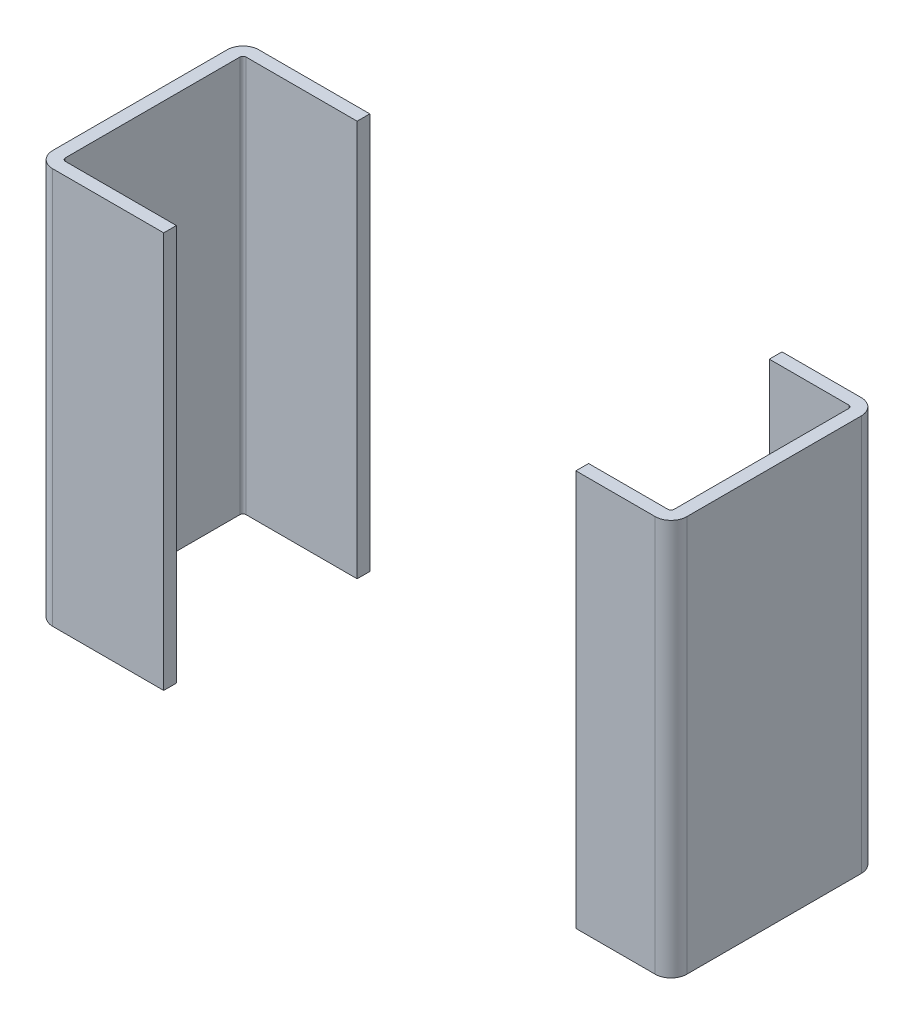
ISO-10303-21;
HEADER;
FILE_DESCRIPTION(('STEP AP214'),'2;1');
FILE_NAME('part.step','',(''),(''),'','','');
FILE_SCHEMA(('AUTOMOTIVE_DESIGN { 1 0 10303 214 1 1 1 1 }'));
ENDSEC;
DATA;
#1=APPLICATION_CONTEXT('core data for automotive mechanical design processes');
#2=APPLICATION_PROTOCOL_DEFINITION('international standard','automotive_design',2000,#1);
#3=PRODUCT_CONTEXT('',#1,'mechanical');
#4=PRODUCT('Part','Part','',(#3));
#5=PRODUCT_RELATED_PRODUCT_CATEGORY('part','',(#4));
#6=PRODUCT_DEFINITION_FORMATION('','',#4);
#7=PRODUCT_DEFINITION_CONTEXT('part definition',#1,'design');
#8=PRODUCT_DEFINITION('design','',#6,#7);
#9=PRODUCT_DEFINITION_SHAPE('','',#8);
#10=(LENGTH_UNIT() NAMED_UNIT(*) SI_UNIT(.MILLI.,.METRE.));
#11=(NAMED_UNIT(*) PLANE_ANGLE_UNIT() SI_UNIT($,.RADIAN.));
#12=(NAMED_UNIT(*) SI_UNIT($,.STERADIAN.) SOLID_ANGLE_UNIT());
#13=UNCERTAINTY_MEASURE_WITH_UNIT(LENGTH_MEASURE(1.E-05),#10,'distance_accuracy_value','');
#14=(GEOMETRIC_REPRESENTATION_CONTEXT(3) GLOBAL_UNCERTAINTY_ASSIGNED_CONTEXT((#13)) GLOBAL_UNIT_ASSIGNED_CONTEXT((#10,
#11,#12)) REPRESENTATION_CONTEXT('',''));
#15=CARTESIAN_POINT('',(0.,0.,0.));
#16=DIRECTION('',(0.,0.,1.));
#17=DIRECTION('',(1.,0.,0.));
#18=AXIS2_PLACEMENT_3D('',#15,#16,#17);
#19=CARTESIAN_POINT('',(0.95,-0.3125,0.6));
#20=DIRECTION('',(0.,1.,0.));
#21=DIRECTION('',(0.707106781186548,0.,0.707106781186548));
#22=AXIS2_PLACEMENT_3D('',#19,#20,#21);
#23=CYLINDRICAL_SURFACE('',#22,0.05);
#24=CARTESIAN_POINT('',(0.95,0.625,0.6));
#25=DIRECTION('',(0.,-1.,0.));
#26=DIRECTION('',(0.707106781186548,0.,0.707106781186548));
#27=AXIS2_PLACEMENT_3D('',#24,#25,#26);
#28=CIRCLE('',#27,0.05);
#29=CARTESIAN_POINT('',(1.,0.625,0.6));
#30=VERTEX_POINT('',#29);
#31=CARTESIAN_POINT('',(0.95,0.625,0.65));
#32=VERTEX_POINT('',#31);
#33=EDGE_CURVE('P0_E144',#30,#32,#28,.T.);
#34=ORIENTED_EDGE('',*,*,#33,.T.);
#35=DIRECTION('',(0.,-1.,0.));
#36=VECTOR('',#35,1.);
#37=CARTESIAN_POINT('',(0.95,-0.3125,0.65));
#38=LINE('',#37,#36);
#39=CARTESIAN_POINT('',(0.95,-0.625,0.65));
#40=VERTEX_POINT('',#39);
#41=EDGE_CURVE('P0_E138',#32,#40,#38,.T.);
#42=ORIENTED_EDGE('',*,*,#41,.T.);
#43=CARTESIAN_POINT('',(0.95,-0.625,0.6));
#44=DIRECTION('',(0.,1.,0.));
#45=DIRECTION('',(0.707106781186548,0.,0.707106781186548));
#46=AXIS2_PLACEMENT_3D('',#43,#44,#45);
#47=CIRCLE('',#46,0.05);
#48=CARTESIAN_POINT('',(1.,-0.625,0.6));
#49=VERTEX_POINT('',#48);
#50=EDGE_CURVE('P0_E141',#40,#49,#47,.T.);
#51=ORIENTED_EDGE('',*,*,#50,.T.);
#52=DIRECTION('',(0.,1.,0.));
#53=VECTOR('',#52,1.);
#54=CARTESIAN_POINT('',(1.,-0.3125,0.6));
#55=LINE('',#54,#53);
#56=EDGE_CURVE('P0_E11',#49,#30,#55,.T.);
#57=ORIENTED_EDGE('',*,*,#56,.T.);
#58=EDGE_LOOP('',(#34,#42,#51,#57));
#59=FACE_BOUND('',#58,.T.);
#60=ADVANCED_FACE('P0_F16',(#59),#23,.T.);
#61=CARTESIAN_POINT('',(1.,-0.625,0.));
#62=DIRECTION('',(1.,0.,0.));
#63=DIRECTION('',(0.,1.,0.));
#64=AXIS2_PLACEMENT_3D('',#61,#62,#63);
#65=PLANE('',#64);
#66=DIRECTION('',(0.,-1.,0.));
#67=VECTOR('',#66,1.);
#68=CARTESIAN_POINT('',(1.,-0.3125,0.05));
#69=LINE('',#68,#67);
#70=CARTESIAN_POINT('',(1.,0.625,0.05));
#71=VERTEX_POINT('',#70);
#72=CARTESIAN_POINT('',(1.,-0.625,0.05));
#73=VERTEX_POINT('',#72);
#74=EDGE_CURVE('P0_E27',#71,#73,#69,.T.);
#75=ORIENTED_EDGE('',*,*,#74,.F.);
#76=DIRECTION('',(0.,0.,1.));
#77=VECTOR('',#76,1.);
#78=CARTESIAN_POINT('',(1.,0.625,0.));
#79=LINE('',#78,#77);
#80=EDGE_CURVE('P0_E223',#71,#30,#79,.T.);
#81=ORIENTED_EDGE('',*,*,#80,.T.);
#82=ORIENTED_EDGE('',*,*,#56,.F.);
#83=DIRECTION('',(0.,0.,1.));
#84=VECTOR('',#83,1.);
#85=CARTESIAN_POINT('',(1.,-0.625,0.));
#86=LINE('',#85,#84);
#87=EDGE_CURVE('P0_E161',#73,#49,#86,.T.);
#88=ORIENTED_EDGE('',*,*,#87,.F.);
#89=EDGE_LOOP('',(#75,#81,#82,#88));
#90=FACE_BOUND('',#89,.T.);
#91=ADVANCED_FACE('P0_F380',(#90),#65,.T.);
#92=CARTESIAN_POINT('',(0.95,-0.3125,0.05));
#93=DIRECTION('',(0.,1.,0.));
#94=DIRECTION('',(0.707106781186548,0.,-0.707106781186548));
#95=AXIS2_PLACEMENT_3D('',#92,#93,#94);
#96=CYLINDRICAL_SURFACE('',#95,0.05);
#97=CARTESIAN_POINT('',(0.95,0.625,0.05));
#98=DIRECTION('',(0.,-1.,0.));
#99=DIRECTION('',(0.707106781186548,0.,-0.707106781186548));
#100=AXIS2_PLACEMENT_3D('',#97,#98,#99);
#101=CIRCLE('',#100,0.05);
#102=CARTESIAN_POINT('',(0.95,0.625,0.));
#103=VERTEX_POINT('',#102);
#104=EDGE_CURVE('P0_E149',#103,#71,#101,.T.);
#105=ORIENTED_EDGE('',*,*,#104,.T.);
#106=ORIENTED_EDGE('',*,*,#74,.T.);
#107=CARTESIAN_POINT('',(0.95,-0.625,0.05));
#108=DIRECTION('',(0.,1.,0.));
#109=DIRECTION('',(0.707106781186548,0.,-0.707106781186548));
#110=AXIS2_PLACEMENT_3D('',#107,#108,#109);
#111=CIRCLE('',#110,0.05);
#112=CARTESIAN_POINT('',(0.95,-0.625,0.));
#113=VERTEX_POINT('',#112);
#114=EDGE_CURVE('P0_E168',#73,#113,#111,.T.);
#115=ORIENTED_EDGE('',*,*,#114,.T.);
#116=DIRECTION('',(0.,1.,0.));
#117=VECTOR('',#116,1.);
#118=CARTESIAN_POINT('',(0.95,-0.3125,0.));
#119=LINE('',#118,#117);
#120=EDGE_CURVE('P0_E212',#113,#103,#119,.T.);
#121=ORIENTED_EDGE('',*,*,#120,.T.);
#122=EDGE_LOOP('',(#105,#106,#115,#121));
#123=FACE_BOUND('',#122,.T.);
#124=ADVANCED_FACE('P0_F375',(#123),#96,.T.);
#125=CARTESIAN_POINT('',(0.,0.,0.65));
#126=DIRECTION('',(0.,0.,1.));
#127=DIRECTION('',(1.,0.,0.));
#128=AXIS2_PLACEMENT_3D('',#125,#126,#127);
#129=PLANE('',#128);
#130=DIRECTION('',(0.,1.,0.));
#131=VECTOR('',#130,1.);
#132=CARTESIAN_POINT('',(0.7,0.3125,0.65));
#133=LINE('',#132,#131);
#134=CARTESIAN_POINT('',(0.7,-0.625,0.65));
#135=VERTEX_POINT('',#134);
#136=CARTESIAN_POINT('',(0.7,0.625,0.65));
#137=VERTEX_POINT('',#136);
#138=EDGE_CURVE('P0_E155',#135,#137,#133,.T.);
#139=ORIENTED_EDGE('',*,*,#138,.F.);
#140=DIRECTION('',(1.,0.,0.));
#141=VECTOR('',#140,1.);
#142=CARTESIAN_POINT('',(-1.,-0.625,0.65));
#143=LINE('',#142,#141);
#144=EDGE_CURVE('P0_E152',#135,#40,#143,.T.);
#145=ORIENTED_EDGE('',*,*,#144,.T.);
#146=ORIENTED_EDGE('',*,*,#41,.F.);
#147=DIRECTION('',(-1.,0.,0.));
#148=VECTOR('',#147,1.);
#149=CARTESIAN_POINT('',(1.,0.625,0.65));
#150=LINE('',#149,#148);
#151=EDGE_CURVE('P0_E216',#32,#137,#150,.T.);
#152=ORIENTED_EDGE('',*,*,#151,.T.);
#153=EDGE_LOOP('',(#139,#145,#146,#152));
#154=FACE_BOUND('',#153,.T.);
#155=ADVANCED_FACE('P0_F153',(#154),#129,.T.);
#156=CARTESIAN_POINT('',(1.,0.625,0.));
#157=DIRECTION('',(0.,1.,0.));
#158=DIRECTION('',(1.,0.,0.));
#159=AXIS2_PLACEMENT_3D('',#156,#157,#158);
#160=PLANE('',#159);
#161=DIRECTION('',(0.,0.,-1.));
#162=VECTOR('',#161,1.);
#163=CARTESIAN_POINT('',(0.7,0.625,0.325));
#164=LINE('',#163,#162);
#165=CARTESIAN_POINT('',(0.7,0.625,0.61));
#166=VERTEX_POINT('',#165);
#167=EDGE_CURVE('P0_E218',#137,#166,#164,.T.);
#168=ORIENTED_EDGE('',*,*,#167,.F.);
#169=ORIENTED_EDGE('',*,*,#151,.F.);
#170=ORIENTED_EDGE('',*,*,#33,.F.);
#171=ORIENTED_EDGE('',*,*,#80,.F.);
#172=ORIENTED_EDGE('',*,*,#104,.F.);
#173=DIRECTION('',(-1.,0.,0.));
#174=VECTOR('',#173,1.);
#175=CARTESIAN_POINT('',(1.,0.625,0.));
#176=LINE('',#175,#174);
#177=CARTESIAN_POINT('',(0.7,0.625,0.));
#178=VERTEX_POINT('',#177);
#179=EDGE_CURVE('P0_E121',#103,#178,#176,.T.);
#180=ORIENTED_EDGE('',*,*,#179,.T.);
#181=DIRECTION('',(0.,0.,-1.));
#182=VECTOR('',#181,1.);
#183=CARTESIAN_POINT('',(0.7,0.625,0.02));
#184=LINE('',#183,#182);
#185=CARTESIAN_POINT('',(0.7,0.625,0.04));
#186=VERTEX_POINT('',#185);
#187=EDGE_CURVE('P0_E186',#186,#178,#184,.T.);
#188=ORIENTED_EDGE('',*,*,#187,.F.);
#189=DIRECTION('',(-1.,0.,0.));
#190=VECTOR('',#189,1.);
#191=CARTESIAN_POINT('',(0.975000000012,0.625,0.04));
#192=LINE('',#191,#190);
#193=CARTESIAN_POINT('',(0.950000000023,0.625,0.04));
#194=VERTEX_POINT('',#193);
#195=EDGE_CURVE('P0_E192',#194,#186,#192,.T.);
#196=ORIENTED_EDGE('',*,*,#195,.F.);
#197=CARTESIAN_POINT('',(0.95,0.625,0.05));
#198=DIRECTION('',(0.,1.,0.));
#199=DIRECTION('',(-1.,0.,-4.656611901632E-09));
#200=AXIS2_PLACEMENT_3D('',#197,#198,#199);
#201=CIRCLE('',#200,0.01);
#202=CARTESIAN_POINT('',(0.96,0.625,0.05000000004657));
#203=VERTEX_POINT('',#202);
#204=EDGE_CURVE('P0_E200',#203,#194,#201,.T.);
#205=ORIENTED_EDGE('',*,*,#204,.F.);
#206=DIRECTION('',(0.,0.,-1.));
#207=VECTOR('',#206,1.);
#208=CARTESIAN_POINT('',(0.96,0.625,0.3));
#209=LINE('',#208,#207);
#210=CARTESIAN_POINT('',(0.96,0.625,0.6));
#211=VERTEX_POINT('',#210);
#212=EDGE_CURVE('P0_E180',#211,#203,#209,.T.);
#213=ORIENTED_EDGE('',*,*,#212,.F.);
#214=CARTESIAN_POINT('',(0.95,0.625,0.6));
#215=DIRECTION('',(0.,1.,0.));
#216=DIRECTION('',(-2.328304216093E-09,0.,-1.));
#217=AXIS2_PLACEMENT_3D('',#214,#215,#216);
#218=CIRCLE('',#217,0.01);
#219=CARTESIAN_POINT('',(0.950000000023,0.625,0.61));
#220=VERTEX_POINT('',#219);
#221=EDGE_CURVE('P0_E184',#220,#211,#218,.T.);
#222=ORIENTED_EDGE('',*,*,#221,.F.);
#223=DIRECTION('',(1.,0.,0.));
#224=VECTOR('',#223,1.);
#225=CARTESIAN_POINT('',(0.85,0.625,0.61));
#226=LINE('',#225,#224);
#227=EDGE_CURVE('P0_E207',#166,#220,#226,.T.);
#228=ORIENTED_EDGE('',*,*,#227,.F.);
#229=EDGE_LOOP('',(#168,#169,#170,#171,#172,#180,#188,#196,#205,#213,#222,#228));
#230=FACE_BOUND('',#229,.T.);
#231=ADVANCED_FACE('P0_F240',(#230),#160,.T.);
#232=CARTESIAN_POINT('',(0.,0.,0.));
#233=DIRECTION('',(0.,0.,1.));
#234=DIRECTION('',(1.,0.,0.));
#235=AXIS2_PLACEMENT_3D('',#232,#233,#234);
#236=PLANE('',#235);
#237=DIRECTION('',(0.,-1.,0.));
#238=VECTOR('',#237,1.);
#239=CARTESIAN_POINT('',(0.7,0.3125,0.));
#240=LINE('',#239,#238);
#241=CARTESIAN_POINT('',(0.7,-0.625,0.));
#242=VERTEX_POINT('',#241);
#243=EDGE_CURVE('P0_E190',#178,#242,#240,.T.);
#244=ORIENTED_EDGE('',*,*,#243,.F.);
#245=ORIENTED_EDGE('',*,*,#179,.F.);
#246=ORIENTED_EDGE('',*,*,#120,.F.);
#247=DIRECTION('',(1.,0.,0.));
#248=VECTOR('',#247,1.);
#249=CARTESIAN_POINT('',(-1.,-0.625,0.));
#250=LINE('',#249,#248);
#251=EDGE_CURVE('P0_E175',#242,#113,#250,.T.);
#252=ORIENTED_EDGE('',*,*,#251,.F.);
#253=EDGE_LOOP('',(#244,#245,#246,#252));
#254=FACE_BOUND('',#253,.T.);
#255=ADVANCED_FACE('P0_F410',(#254),#236,.F.);
#256=CARTESIAN_POINT('',(-1.,-0.625,0.));
#257=DIRECTION('',(0.,-1.,0.));
#258=DIRECTION('',(0.,0.,-1.));
#259=AXIS2_PLACEMENT_3D('',#256,#257,#258);
#260=PLANE('',#259);
#261=DIRECTION('',(0.,0.,1.));
#262=VECTOR('',#261,1.);
#263=CARTESIAN_POINT('',(0.7,-0.625,0.325));
#264=LINE('',#263,#262);
#265=CARTESIAN_POINT('',(0.7,-0.625,0.61));
#266=VERTEX_POINT('',#265);
#267=EDGE_CURVE('P0_E219',#266,#135,#264,.T.);
#268=ORIENTED_EDGE('',*,*,#267,.F.);
#269=DIRECTION('',(-1.,0.,0.));
#270=VECTOR('',#269,1.);
#271=CARTESIAN_POINT('',(-0.15,-0.625,0.61));
#272=LINE('',#271,#270);
#273=CARTESIAN_POINT('',(0.950000000023,-0.625,0.61));
#274=VERTEX_POINT('',#273);
#275=EDGE_CURVE('P0_E268',#274,#266,#272,.T.);
#276=ORIENTED_EDGE('',*,*,#275,.F.);
#277=CARTESIAN_POINT('',(0.95,-0.625,0.6));
#278=DIRECTION('',(0.,-1.,0.));
#279=DIRECTION('',(-2.328304216093E-09,0.,-1.));
#280=AXIS2_PLACEMENT_3D('',#277,#278,#279);
#281=CIRCLE('',#280,0.01);
#282=CARTESIAN_POINT('',(0.96,-0.625,0.6));
#283=VERTEX_POINT('',#282);
#284=EDGE_CURVE('P0_E204',#283,#274,#281,.T.);
#285=ORIENTED_EDGE('',*,*,#284,.F.);
#286=DIRECTION('',(0.,0.,1.));
#287=VECTOR('',#286,1.);
#288=CARTESIAN_POINT('',(0.96,-0.625,0.3));
#289=LINE('',#288,#287);
#290=CARTESIAN_POINT('',(0.96,-0.625,0.05000000004657));
#291=VERTEX_POINT('',#290);
#292=EDGE_CURVE('P0_E181',#291,#283,#289,.T.);
#293=ORIENTED_EDGE('',*,*,#292,.F.);
#294=CARTESIAN_POINT('',(0.95,-0.625,0.05));
#295=DIRECTION('',(0.,-1.,0.));
#296=DIRECTION('',(-1.,0.,-4.656611901632E-09));
#297=AXIS2_PLACEMENT_3D('',#294,#295,#296);
#298=CIRCLE('',#297,0.01);
#299=CARTESIAN_POINT('',(0.950000000023,-0.625,0.04));
#300=VERTEX_POINT('',#299);
#301=EDGE_CURVE('P0_E108',#300,#291,#298,.T.);
#302=ORIENTED_EDGE('',*,*,#301,.F.);
#303=DIRECTION('',(1.,0.,0.));
#304=VECTOR('',#303,1.);
#305=CARTESIAN_POINT('',(-0.02499999998836,-0.625,0.04));
#306=LINE('',#305,#304);
#307=CARTESIAN_POINT('',(0.7,-0.625,0.04));
#308=VERTEX_POINT('',#307);
#309=EDGE_CURVE('P0_E249',#308,#300,#306,.T.);
#310=ORIENTED_EDGE('',*,*,#309,.F.);
#311=DIRECTION('',(0.,0.,1.));
#312=VECTOR('',#311,1.);
#313=CARTESIAN_POINT('',(0.7,-0.625,0.02));
#314=LINE('',#313,#312);
#315=EDGE_CURVE('P0_E270',#242,#308,#314,.T.);
#316=ORIENTED_EDGE('',*,*,#315,.F.);
#317=ORIENTED_EDGE('',*,*,#251,.T.);
#318=ORIENTED_EDGE('',*,*,#114,.F.);
#319=ORIENTED_EDGE('',*,*,#87,.T.);
#320=ORIENTED_EDGE('',*,*,#50,.F.);
#321=ORIENTED_EDGE('',*,*,#144,.F.);
#322=EDGE_LOOP('',(#268,#276,#285,#293,#302,#310,#316,#317,#318,#319,#320,#321));
#323=FACE_BOUND('',#322,.T.);
#324=ADVANCED_FACE('P0_F159',(#323),#260,.T.);
#325=CARTESIAN_POINT('',(0.95,0.625,0.6));
#326=DIRECTION('',(0.,-1.,0.));
#327=DIRECTION('',(-2.328304216093E-09,0.,-1.));
#328=AXIS2_PLACEMENT_3D('',#325,#326,#327);
#329=CYLINDRICAL_SURFACE('',#328,0.01);
#330=ORIENTED_EDGE('',*,*,#284,.T.);
#331=DIRECTION('',(0.,-1.,0.));
#332=VECTOR('',#331,1.);
#333=CARTESIAN_POINT('',(0.950000000023,0.625,0.61));
#334=LINE('',#333,#332);
#335=EDGE_CURVE('P0_E20',#220,#274,#334,.T.);
#336=ORIENTED_EDGE('',*,*,#335,.F.);
#337=ORIENTED_EDGE('',*,*,#221,.T.);
#338=DIRECTION('',(0.,-1.,0.));
#339=VECTOR('',#338,1.);
#340=CARTESIAN_POINT('',(0.96,0.625,0.6));
#341=LINE('',#340,#339);
#342=EDGE_CURVE('P0_E176',#211,#283,#341,.T.);
#343=ORIENTED_EDGE('',*,*,#342,.T.);
#344=EDGE_LOOP('',(#330,#336,#337,#343));
#345=FACE_BOUND('',#344,.T.);
#346=ADVANCED_FACE('P0_F424',(#345),#329,.F.);
#347=CARTESIAN_POINT('',(0.96,0.625,0.6));
#348=DIRECTION('',(-1.,0.,0.));
#349=DIRECTION('',(0.,0.,1.));
#350=AXIS2_PLACEMENT_3D('',#347,#348,#349);
#351=PLANE('',#350);
#352=ORIENTED_EDGE('',*,*,#292,.T.);
#353=ORIENTED_EDGE('',*,*,#342,.F.);
#354=ORIENTED_EDGE('',*,*,#212,.T.);
#355=DIRECTION('',(0.,-1.,0.));
#356=VECTOR('',#355,1.);
#357=CARTESIAN_POINT('',(0.96,0.625,0.05000000004657));
#358=LINE('',#357,#356);
#359=EDGE_CURVE('P0_E196',#203,#291,#358,.T.);
#360=ORIENTED_EDGE('',*,*,#359,.T.);
#361=EDGE_LOOP('',(#352,#353,#354,#360));
#362=FACE_BOUND('',#361,.T.);
#363=ADVANCED_FACE('P0_F236',(#362),#351,.T.);
#364=CARTESIAN_POINT('',(0.95,0.625,0.05));
#365=DIRECTION('',(0.,-1.,0.));
#366=DIRECTION('',(-1.,0.,-4.656611901632E-09));
#367=AXIS2_PLACEMENT_3D('',#364,#365,#366);
#368=CYLINDRICAL_SURFACE('',#367,0.01);
#369=ORIENTED_EDGE('',*,*,#301,.T.);
#370=ORIENTED_EDGE('',*,*,#359,.F.);
#371=ORIENTED_EDGE('',*,*,#204,.T.);
#372=DIRECTION('',(0.,-1.,0.));
#373=VECTOR('',#372,1.);
#374=CARTESIAN_POINT('',(0.950000000023,0.625,0.04));
#375=LINE('',#374,#373);
#376=EDGE_CURVE('P0_E195',#194,#300,#375,.T.);
#377=ORIENTED_EDGE('',*,*,#376,.T.);
#378=EDGE_LOOP('',(#369,#370,#371,#377));
#379=FACE_BOUND('',#378,.T.);
#380=ADVANCED_FACE('P0_F245',(#379),#368,.F.);
#381=CARTESIAN_POINT('',(0.950000000023,0.625,0.04));
#382=DIRECTION('',(0.,0.,1.));
#383=DIRECTION('',(1.,0.,0.));
#384=AXIS2_PLACEMENT_3D('',#381,#382,#383);
#385=PLANE('',#384);
#386=ORIENTED_EDGE('',*,*,#309,.T.);
#387=ORIENTED_EDGE('',*,*,#376,.F.);
#388=ORIENTED_EDGE('',*,*,#195,.T.);
#389=DIRECTION('',(0.,-1.,0.));
#390=VECTOR('',#389,1.);
#391=CARTESIAN_POINT('',(0.7,0.625,0.04));
#392=LINE('',#391,#390);
#393=EDGE_CURVE('P0_E191',#186,#308,#392,.T.);
#394=ORIENTED_EDGE('',*,*,#393,.T.);
#395=EDGE_LOOP('',(#386,#387,#388,#394));
#396=FACE_BOUND('',#395,.T.);
#397=ADVANCED_FACE('P0_F18',(#396),#385,.T.);
#398=CARTESIAN_POINT('',(0.7,0.625,0.04));
#399=DIRECTION('',(-1.,0.,0.));
#400=DIRECTION('',(0.,0.,1.));
#401=AXIS2_PLACEMENT_3D('',#398,#399,#400);
#402=PLANE('',#401);
#403=ORIENTED_EDGE('',*,*,#315,.T.);
#404=ORIENTED_EDGE('',*,*,#393,.F.);
#405=ORIENTED_EDGE('',*,*,#187,.T.);
#406=ORIENTED_EDGE('',*,*,#243,.T.);
#407=EDGE_LOOP('',(#403,#404,#405,#406));
#408=FACE_BOUND('',#407,.T.);
#409=ADVANCED_FACE('P0_F404',(#408),#402,.T.);
#410=CARTESIAN_POINT('',(0.7,0.625,0.65));
#411=DIRECTION('',(-1.,0.,0.));
#412=DIRECTION('',(0.,0.,1.));
#413=AXIS2_PLACEMENT_3D('',#410,#411,#412);
#414=PLANE('',#413);
#415=ORIENTED_EDGE('',*,*,#267,.T.);
#416=ORIENTED_EDGE('',*,*,#138,.T.);
#417=ORIENTED_EDGE('',*,*,#167,.T.);
#418=DIRECTION('',(0.,-1.,0.));
#419=VECTOR('',#418,1.);
#420=CARTESIAN_POINT('',(0.7,0.625,0.61));
#421=LINE('',#420,#419);
#422=EDGE_CURVE('P0_E211',#166,#266,#421,.T.);
#423=ORIENTED_EDGE('',*,*,#422,.T.);
#424=EDGE_LOOP('',(#415,#416,#417,#423));
#425=FACE_BOUND('',#424,.T.);
#426=ADVANCED_FACE('P0_F369',(#425),#414,.T.);
#427=CARTESIAN_POINT('',(0.7,0.625,0.61));
#428=DIRECTION('',(0.,0.,-1.));
#429=DIRECTION('',(0.,-1.,0.));
#430=AXIS2_PLACEMENT_3D('',#427,#428,#429);
#431=PLANE('',#430);
#432=ORIENTED_EDGE('',*,*,#275,.T.);
#433=ORIENTED_EDGE('',*,*,#422,.F.);
#434=ORIENTED_EDGE('',*,*,#227,.T.);
#435=ORIENTED_EDGE('',*,*,#335,.T.);
#436=EDGE_LOOP('',(#432,#433,#434,#435));
#437=FACE_BOUND('',#436,.T.);
#438=ADVANCED_FACE('P0_F365',(#437),#431,.T.);
#439=CLOSED_SHELL('',(#60,#91,#124,#155,#231,#255,#324,#346,#363,#380,#397,#409,#426,#438));
#440=MANIFOLD_SOLID_BREP('P0_B1',#439);
#441=CARTESIAN_POINT('',(-0.95,0.625,0.6));
#442=DIRECTION('',(0.,-1.,0.));
#443=DIRECTION('',(1.,0.,0.));
#444=AXIS2_PLACEMENT_3D('',#441,#442,#443);
#445=CYLINDRICAL_SURFACE('',#444,0.01);
#446=CARTESIAN_POINT('',(-0.95,-0.625,0.6));
#447=DIRECTION('',(0.,-1.,0.));
#448=DIRECTION('',(1.,0.,0.));
#449=AXIS2_PLACEMENT_3D('',#446,#447,#448);
#450=CIRCLE('',#449,0.01);
#451=CARTESIAN_POINT('',(-0.95,-0.625,0.61));
#452=VERTEX_POINT('',#451);
#453=CARTESIAN_POINT('',(-0.96,-0.625,0.6));
#454=VERTEX_POINT('',#453);
#455=EDGE_CURVE('P1_E103',#452,#454,#450,.T.);
#456=ORIENTED_EDGE('',*,*,#455,.T.);
#457=DIRECTION('',(0.,-1.,0.));
#458=VECTOR('',#457,1.);
#459=CARTESIAN_POINT('',(-0.96,0.625,0.6));
#460=LINE('',#459,#458);
#461=CARTESIAN_POINT('',(-0.96,0.625,0.6));
#462=VERTEX_POINT('',#461);
#463=EDGE_CURVE('P1_E11',#462,#454,#460,.T.);
#464=ORIENTED_EDGE('',*,*,#463,.F.);
#465=CARTESIAN_POINT('',(-0.95,0.625,0.6));
#466=DIRECTION('',(0.,1.,0.));
#467=DIRECTION('',(1.,0.,0.));
#468=AXIS2_PLACEMENT_3D('',#465,#466,#467);
#469=CIRCLE('',#468,0.01);
#470=CARTESIAN_POINT('',(-0.95,0.625,0.61));
#471=VERTEX_POINT('',#470);
#472=EDGE_CURVE('P1_E165',#462,#471,#469,.T.);
#473=ORIENTED_EDGE('',*,*,#472,.T.);
#474=DIRECTION('',(0.,-1.,0.));
#475=VECTOR('',#474,1.);
#476=CARTESIAN_POINT('',(-0.95,0.625,0.61));
#477=LINE('',#476,#475);
#478=EDGE_CURVE('P1_E41',#471,#452,#477,.T.);
#479=ORIENTED_EDGE('',*,*,#478,.T.);
#480=EDGE_LOOP('',(#456,#464,#473,#479));
#481=FACE_BOUND('',#480,.T.);
#482=ADVANCED_FACE('P1_F16',(#481),#445,.F.);
#483=CARTESIAN_POINT('',(-0.96,0.625,0.05000000004657));
#484=DIRECTION('',(1.,0.,0.));
#485=DIRECTION('',(0.,0.,-1.));
#486=AXIS2_PLACEMENT_3D('',#483,#484,#485);
#487=PLANE('',#486);
#488=DIRECTION('',(0.,0.,-1.));
#489=VECTOR('',#488,1.);
#490=CARTESIAN_POINT('',(-0.96,-0.625,0.02500000002328));
#491=LINE('',#490,#489);
#492=CARTESIAN_POINT('',(-0.96,-0.625,0.05000000004657));
#493=VERTEX_POINT('',#492);
#494=EDGE_CURVE('P1_E98',#454,#493,#491,.T.);
#495=ORIENTED_EDGE('',*,*,#494,.T.);
#496=DIRECTION('',(0.,-1.,0.));
#497=VECTOR('',#496,1.);
#498=CARTESIAN_POINT('',(-0.96,0.625,0.05000000004657));
#499=LINE('',#498,#497);
#500=CARTESIAN_POINT('',(-0.96,0.625,0.05000000004657));
#501=VERTEX_POINT('',#500);
#502=EDGE_CURVE('P1_E27',#501,#493,#499,.T.);
#503=ORIENTED_EDGE('',*,*,#502,.F.);
#504=DIRECTION('',(0.,0.,1.));
#505=VECTOR('',#504,1.);
#506=CARTESIAN_POINT('',(-0.96,0.625,0.02500000002328));
#507=LINE('',#506,#505);
#508=EDGE_CURVE('P1_E162',#501,#462,#507,.T.);
#509=ORIENTED_EDGE('',*,*,#508,.T.);
#510=ORIENTED_EDGE('',*,*,#463,.T.);
#511=EDGE_LOOP('',(#495,#503,#509,#510));
#512=FACE_BOUND('',#511,.T.);
#513=ADVANCED_FACE('P1_F99',(#512),#487,.T.);
#514=CARTESIAN_POINT('',(-0.95,0.625,0.05));
#515=DIRECTION('',(0.,-1.,0.));
#516=DIRECTION('',(0.,0.,1.));
#517=AXIS2_PLACEMENT_3D('',#514,#515,#516);
#518=CYLINDRICAL_SURFACE('',#517,0.01);
#519=CARTESIAN_POINT('',(-0.95,-0.625,0.05));
#520=DIRECTION('',(0.,-1.,0.));
#521=DIRECTION('',(0.,0.,1.));
#522=AXIS2_PLACEMENT_3D('',#519,#520,#521);
#523=CIRCLE('',#522,0.01);
#524=CARTESIAN_POINT('',(-0.95,-0.625,0.04));
#525=VERTEX_POINT('',#524);
#526=EDGE_CURVE('P1_E87',#493,#525,#523,.T.);
#527=ORIENTED_EDGE('',*,*,#526,.T.);
#528=DIRECTION('',(0.,-1.,0.));
#529=VECTOR('',#528,1.);
#530=CARTESIAN_POINT('',(-0.95,0.625,0.04));
#531=LINE('',#530,#529);
#532=CARTESIAN_POINT('',(-0.95,0.625,0.04));
#533=VERTEX_POINT('',#532);
#534=EDGE_CURVE('P1_E95',#533,#525,#531,.T.);
#535=ORIENTED_EDGE('',*,*,#534,.F.);
#536=CARTESIAN_POINT('',(-0.95,0.625,0.05));
#537=DIRECTION('',(0.,1.,0.));
#538=DIRECTION('',(0.,0.,1.));
#539=AXIS2_PLACEMENT_3D('',#536,#537,#538);
#540=CIRCLE('',#539,0.01);
#541=EDGE_CURVE('P1_E90',#533,#501,#540,.T.);
#542=ORIENTED_EDGE('',*,*,#541,.T.);
#543=ORIENTED_EDGE('',*,*,#502,.T.);
#544=EDGE_LOOP('',(#527,#535,#542,#543));
#545=FACE_BOUND('',#544,.T.);
#546=ADVANCED_FACE('P1_F84',(#545),#518,.F.);
#547=CARTESIAN_POINT('',(-0.6,0.625,0.04));
#548=DIRECTION('',(0.,0.,1.));
#549=DIRECTION('',(1.,0.,0.));
#550=AXIS2_PLACEMENT_3D('',#547,#548,#549);
#551=PLANE('',#550);
#552=DIRECTION('',(1.,0.,0.));
#553=VECTOR('',#552,1.);
#554=CARTESIAN_POINT('',(-0.8,-0.625,0.04));
#555=LINE('',#554,#553);
#556=CARTESIAN_POINT('',(-0.6,-0.625,0.04));
#557=VERTEX_POINT('',#556);
#558=EDGE_CURVE('P1_E109',#525,#557,#555,.T.);
#559=ORIENTED_EDGE('',*,*,#558,.T.);
#560=DIRECTION('',(0.,-1.,0.));
#561=VECTOR('',#560,1.);
#562=CARTESIAN_POINT('',(-0.6,0.625,0.04));
#563=LINE('',#562,#561);
#564=CARTESIAN_POINT('',(-0.6,0.625,0.04));
#565=VERTEX_POINT('',#564);
#566=EDGE_CURVE('P1_E211',#565,#557,#563,.T.);
#567=ORIENTED_EDGE('',*,*,#566,.F.);
#568=DIRECTION('',(-1.,0.,0.));
#569=VECTOR('',#568,1.);
#570=CARTESIAN_POINT('',(0.2,0.625,0.04));
#571=LINE('',#570,#569);
#572=EDGE_CURVE('P1_E20',#565,#533,#571,.T.);
#573=ORIENTED_EDGE('',*,*,#572,.T.);
#574=ORIENTED_EDGE('',*,*,#534,.T.);
#575=EDGE_LOOP('',(#559,#567,#573,#574));
#576=FACE_BOUND('',#575,.T.);
#577=ADVANCED_FACE('P1_F18',(#576),#551,.T.);
#578=CARTESIAN_POINT('',(-0.6,0.625,0.));
#579=DIRECTION('',(1.,0.,0.));
#580=DIRECTION('',(0.,1.,0.));
#581=AXIS2_PLACEMENT_3D('',#578,#579,#580);
#582=PLANE('',#581);
#583=DIRECTION('',(0.,0.,-1.));
#584=VECTOR('',#583,1.);
#585=CARTESIAN_POINT('',(-0.6,-0.625,0.));
#586=LINE('',#585,#584);
#587=CARTESIAN_POINT('',(-0.6,-0.625,0.));
#588=VERTEX_POINT('',#587);
#589=EDGE_CURVE('P1_E116',#557,#588,#586,.T.);
#590=ORIENTED_EDGE('',*,*,#589,.T.);
#591=DIRECTION('',(0.,1.,0.));
#592=VECTOR('',#591,1.);
#593=CARTESIAN_POINT('',(-0.6,0.3125,0.));
#594=LINE('',#593,#592);
#595=CARTESIAN_POINT('',(-0.6,0.625,0.));
#596=VERTEX_POINT('',#595);
#597=EDGE_CURVE('P1_E183',#588,#596,#594,.T.);
#598=ORIENTED_EDGE('',*,*,#597,.T.);
#599=DIRECTION('',(0.,0.,1.));
#600=VECTOR('',#599,1.);
#601=CARTESIAN_POINT('',(-0.6,0.625,0.));
#602=LINE('',#601,#600);
#603=EDGE_CURVE('P1_E122',#596,#565,#602,.T.);
#604=ORIENTED_EDGE('',*,*,#603,.T.);
#605=ORIENTED_EDGE('',*,*,#566,.T.);
#606=EDGE_LOOP('',(#590,#598,#604,#605));
#607=FACE_BOUND('',#606,.T.);
#608=ADVANCED_FACE('P1_F452',(#607),#582,.T.);
#609=CARTESIAN_POINT('',(-0.6,0.625,0.61));
#610=DIRECTION('',(1.,0.,0.));
#611=DIRECTION('',(0.,1.,0.));
#612=AXIS2_PLACEMENT_3D('',#609,#610,#611);
#613=PLANE('',#612);
#614=DIRECTION('',(0.,0.,-1.));
#615=VECTOR('',#614,1.);
#616=CARTESIAN_POINT('',(-0.6,-0.625,0.305));
#617=LINE('',#616,#615);
#618=CARTESIAN_POINT('',(-0.6,-0.625,0.65));
#619=VERTEX_POINT('',#618);
#620=CARTESIAN_POINT('',(-0.6,-0.625,0.61));
#621=VERTEX_POINT('',#620);
#622=EDGE_CURVE('P1_E200',#619,#621,#617,.T.);
#623=ORIENTED_EDGE('',*,*,#622,.T.);
#624=DIRECTION('',(0.,-1.,0.));
#625=VECTOR('',#624,1.);
#626=CARTESIAN_POINT('',(-0.6,0.625,0.61));
#627=LINE('',#626,#625);
#628=CARTESIAN_POINT('',(-0.6,0.625,0.61));
#629=VERTEX_POINT('',#628);
#630=EDGE_CURVE('P1_E208',#629,#621,#627,.T.);
#631=ORIENTED_EDGE('',*,*,#630,.F.);
#632=DIRECTION('',(0.,0.,1.));
#633=VECTOR('',#632,1.);
#634=CARTESIAN_POINT('',(-0.6,0.625,0.305));
#635=LINE('',#634,#633);
#636=CARTESIAN_POINT('',(-0.6,0.625,0.65));
#637=VERTEX_POINT('',#636);
#638=EDGE_CURVE('P1_E119',#629,#637,#635,.T.);
#639=ORIENTED_EDGE('',*,*,#638,.T.);
#640=DIRECTION('',(0.,-1.,0.));
#641=VECTOR('',#640,1.);
#642=CARTESIAN_POINT('',(-0.6,0.3125,0.65));
#643=LINE('',#642,#641);
#644=EDGE_CURVE('P1_E156',#637,#619,#643,.T.);
#645=ORIENTED_EDGE('',*,*,#644,.T.);
#646=EDGE_LOOP('',(#623,#631,#639,#645));
#647=FACE_BOUND('',#646,.T.);
#648=ADVANCED_FACE('P1_F299',(#647),#613,.T.);
#649=CARTESIAN_POINT('',(-0.95,0.625,0.61));
#650=DIRECTION('',(0.,0.,-1.));
#651=DIRECTION('',(0.,-1.,0.));
#652=AXIS2_PLACEMENT_3D('',#649,#650,#651);
#653=PLANE('',#652);
#654=DIRECTION('',(-1.,0.,0.));
#655=VECTOR('',#654,1.);
#656=CARTESIAN_POINT('',(-0.975,-0.625,0.61));
#657=LINE('',#656,#655);
#658=EDGE_CURVE('P1_E134',#621,#452,#657,.T.);
#659=ORIENTED_EDGE('',*,*,#658,.T.);
#660=ORIENTED_EDGE('',*,*,#478,.F.);
#661=DIRECTION('',(1.,0.,0.));
#662=VECTOR('',#661,1.);
#663=CARTESIAN_POINT('',(0.025,0.625,0.61));
#664=LINE('',#663,#662);
#665=EDGE_CURVE('P1_E201',#471,#629,#664,.T.);
#666=ORIENTED_EDGE('',*,*,#665,.T.);
#667=ORIENTED_EDGE('',*,*,#630,.T.);
#668=EDGE_LOOP('',(#659,#660,#666,#667));
#669=FACE_BOUND('',#668,.T.);
#670=ADVANCED_FACE('P1_F302',(#669),#653,.T.);
#671=CARTESIAN_POINT('',(-1.,-0.625,0.));
#672=DIRECTION('',(0.,-1.,0.));
#673=DIRECTION('',(0.,0.,-1.));
#674=AXIS2_PLACEMENT_3D('',#671,#672,#673);
#675=PLANE('',#674);
#676=ORIENTED_EDGE('',*,*,#622,.F.);
#677=DIRECTION('',(1.,0.,0.));
#678=VECTOR('',#677,1.);
#679=CARTESIAN_POINT('',(-1.,-0.625,0.65));
#680=LINE('',#679,#678);
#681=CARTESIAN_POINT('',(-0.95,-0.625,0.65));
#682=VERTEX_POINT('',#681);
#683=EDGE_CURVE('P1_E196',#682,#619,#680,.T.);
#684=ORIENTED_EDGE('',*,*,#683,.F.);
#685=CARTESIAN_POINT('',(-0.95,-0.625,0.6));
#686=DIRECTION('',(0.,1.,0.));
#687=DIRECTION('',(-0.707106781186548,0.,0.707106781186548));
#688=AXIS2_PLACEMENT_3D('',#685,#686,#687);
#689=CIRCLE('',#688,0.05);
#690=CARTESIAN_POINT('',(-1.,-0.625,0.6));
#691=VERTEX_POINT('',#690);
#692=EDGE_CURVE('P1_E131',#691,#682,#689,.T.);
#693=ORIENTED_EDGE('',*,*,#692,.F.);
#694=DIRECTION('',(0.,0.,1.));
#695=VECTOR('',#694,1.);
#696=CARTESIAN_POINT('',(-1.,-0.625,0.));
#697=LINE('',#696,#695);
#698=CARTESIAN_POINT('',(-1.,-0.625,0.05));
#699=VERTEX_POINT('',#698);
#700=EDGE_CURVE('P1_E168',#699,#691,#697,.T.);
#701=ORIENTED_EDGE('',*,*,#700,.F.);
#702=CARTESIAN_POINT('',(-0.95,-0.625,0.05));
#703=DIRECTION('',(0.,1.,0.));
#704=DIRECTION('',(-0.707106781186548,0.,-0.707106781186548));
#705=AXIS2_PLACEMENT_3D('',#702,#703,#704);
#706=CIRCLE('',#705,0.05);
#707=CARTESIAN_POINT('',(-0.95,-0.625,0.));
#708=VERTEX_POINT('',#707);
#709=EDGE_CURVE('P1_E148',#708,#699,#706,.T.);
#710=ORIENTED_EDGE('',*,*,#709,.F.);
#711=DIRECTION('',(1.,0.,0.));
#712=VECTOR('',#711,1.);
#713=CARTESIAN_POINT('',(-1.,-0.625,0.));
#714=LINE('',#713,#712);
#715=EDGE_CURVE('P1_E172',#708,#588,#714,.T.);
#716=ORIENTED_EDGE('',*,*,#715,.T.);
#717=ORIENTED_EDGE('',*,*,#589,.F.);
#718=ORIENTED_EDGE('',*,*,#558,.F.);
#719=ORIENTED_EDGE('',*,*,#526,.F.);
#720=ORIENTED_EDGE('',*,*,#494,.F.);
#721=ORIENTED_EDGE('',*,*,#455,.F.);
#722=ORIENTED_EDGE('',*,*,#658,.F.);
#723=EDGE_LOOP('',(#676,#684,#693,#701,#710,#716,#717,#718,#719,#720,#721,#722));
#724=FACE_BOUND('',#723,.T.);
#725=ADVANCED_FACE('P1_F106',(#724),#675,.T.);
#726=CARTESIAN_POINT('',(0.,0.,0.65));
#727=DIRECTION('',(0.,0.,1.));
#728=DIRECTION('',(1.,0.,0.));
#729=AXIS2_PLACEMENT_3D('',#726,#727,#728);
#730=PLANE('',#729);
#731=ORIENTED_EDGE('',*,*,#644,.F.);
#732=DIRECTION('',(-1.,0.,0.));
#733=VECTOR('',#732,1.);
#734=CARTESIAN_POINT('',(1.,0.625,0.65));
#735=LINE('',#734,#733);
#736=CARTESIAN_POINT('',(-0.95,0.625,0.65));
#737=VERTEX_POINT('',#736);
#738=EDGE_CURVE('P1_E126',#637,#737,#735,.T.);
#739=ORIENTED_EDGE('',*,*,#738,.T.);
#740=DIRECTION('',(0.,1.,0.));
#741=VECTOR('',#740,1.);
#742=CARTESIAN_POINT('',(-0.95,0.3125,0.65));
#743=LINE('',#742,#741);
#744=EDGE_CURVE('P1_E135',#682,#737,#743,.T.);
#745=ORIENTED_EDGE('',*,*,#744,.F.);
#746=ORIENTED_EDGE('',*,*,#683,.T.);
#747=EDGE_LOOP('',(#731,#739,#745,#746));
#748=FACE_BOUND('',#747,.T.);
#749=ADVANCED_FACE('P1_F419',(#748),#730,.T.);
#750=CARTESIAN_POINT('',(1.,0.625,0.));
#751=DIRECTION('',(0.,1.,0.));
#752=DIRECTION('',(1.,0.,0.));
#753=AXIS2_PLACEMENT_3D('',#750,#751,#752);
#754=PLANE('',#753);
#755=ORIENTED_EDGE('',*,*,#638,.F.);
#756=ORIENTED_EDGE('',*,*,#665,.F.);
#757=ORIENTED_EDGE('',*,*,#472,.F.);
#758=ORIENTED_EDGE('',*,*,#508,.F.);
#759=ORIENTED_EDGE('',*,*,#541,.F.);
#760=ORIENTED_EDGE('',*,*,#572,.F.);
#761=ORIENTED_EDGE('',*,*,#603,.F.);
#762=DIRECTION('',(-1.,0.,0.));
#763=VECTOR('',#762,1.);
#764=CARTESIAN_POINT('',(1.,0.625,0.));
#765=LINE('',#764,#763);
#766=CARTESIAN_POINT('',(-0.95,0.625,0.));
#767=VERTEX_POINT('',#766);
#768=EDGE_CURVE('P1_E169',#596,#767,#765,.T.);
#769=ORIENTED_EDGE('',*,*,#768,.T.);
#770=CARTESIAN_POINT('',(-0.95,0.625,0.05));
#771=DIRECTION('',(0.,-1.,0.));
#772=DIRECTION('',(-0.707106781186548,0.,-0.707106781186548));
#773=AXIS2_PLACEMENT_3D('',#770,#771,#772);
#774=CIRCLE('',#773,0.05);
#775=CARTESIAN_POINT('',(-1.,0.625,0.05));
#776=VERTEX_POINT('',#775);
#777=EDGE_CURVE('P1_E161',#776,#767,#774,.T.);
#778=ORIENTED_EDGE('',*,*,#777,.F.);
#779=DIRECTION('',(0.,0.,1.));
#780=VECTOR('',#779,1.);
#781=CARTESIAN_POINT('',(-1.,0.625,0.));
#782=LINE('',#781,#780);
#783=CARTESIAN_POINT('',(-1.,0.625,0.6));
#784=VERTEX_POINT('',#783);
#785=EDGE_CURVE('P1_E127',#776,#784,#782,.T.);
#786=ORIENTED_EDGE('',*,*,#785,.T.);
#787=CARTESIAN_POINT('',(-0.95,0.625,0.6));
#788=DIRECTION('',(0.,-1.,0.));
#789=DIRECTION('',(-0.707106781186548,0.,0.707106781186548));
#790=AXIS2_PLACEMENT_3D('',#787,#788,#789);
#791=CIRCLE('',#790,0.05);
#792=EDGE_CURVE('P1_E138',#737,#784,#791,.T.);
#793=ORIENTED_EDGE('',*,*,#792,.F.);
#794=ORIENTED_EDGE('',*,*,#738,.F.);
#795=EDGE_LOOP('',(#755,#756,#757,#758,#759,#760,#761,#769,#778,#786,#793,#794));
#796=FACE_BOUND('',#795,.T.);
#797=ADVANCED_FACE('P1_F238',(#796),#754,.T.);
#798=CARTESIAN_POINT('',(0.,0.,0.));
#799=DIRECTION('',(0.,0.,1.));
#800=DIRECTION('',(1.,0.,0.));
#801=AXIS2_PLACEMENT_3D('',#798,#799,#800);
#802=PLANE('',#801);
#803=ORIENTED_EDGE('',*,*,#597,.F.);
#804=ORIENTED_EDGE('',*,*,#715,.F.);
#805=DIRECTION('',(0.,-1.,0.));
#806=VECTOR('',#805,1.);
#807=CARTESIAN_POINT('',(-0.95,0.3125,0.));
#808=LINE('',#807,#806);
#809=EDGE_CURVE('P1_E175',#767,#708,#808,.T.);
#810=ORIENTED_EDGE('',*,*,#809,.F.);
#811=ORIENTED_EDGE('',*,*,#768,.F.);
#812=EDGE_LOOP('',(#803,#804,#810,#811));
#813=FACE_BOUND('',#812,.T.);
#814=ADVANCED_FACE('P1_F429',(#813),#802,.F.);
#815=CARTESIAN_POINT('',(-0.95,0.3125,0.05));
#816=DIRECTION('',(0.,-1.,0.));
#817=DIRECTION('',(-0.707106781186548,0.,-0.707106781186548));
#818=AXIS2_PLACEMENT_3D('',#815,#816,#817);
#819=CYLINDRICAL_SURFACE('',#818,0.05);
#820=ORIENTED_EDGE('',*,*,#709,.T.);
#821=DIRECTION('',(0.,1.,0.));
#822=VECTOR('',#821,1.);
#823=CARTESIAN_POINT('',(-1.,0.3125,0.05));
#824=LINE('',#823,#822);
#825=EDGE_CURVE('P1_E193',#699,#776,#824,.T.);
#826=ORIENTED_EDGE('',*,*,#825,.T.);
#827=ORIENTED_EDGE('',*,*,#777,.T.);
#828=ORIENTED_EDGE('',*,*,#809,.T.);
#829=EDGE_LOOP('',(#820,#826,#827,#828));
#830=FACE_BOUND('',#829,.T.);
#831=ADVANCED_FACE('P1_F259',(#830),#819,.T.);
#832=CARTESIAN_POINT('',(-0.95,0.3125,0.6));
#833=DIRECTION('',(0.,-1.,0.));
#834=DIRECTION('',(-0.707106781186548,0.,0.707106781186548));
#835=AXIS2_PLACEMENT_3D('',#832,#833,#834);
#836=CYLINDRICAL_SURFACE('',#835,0.05);
#837=ORIENTED_EDGE('',*,*,#692,.T.);
#838=ORIENTED_EDGE('',*,*,#744,.T.);
#839=ORIENTED_EDGE('',*,*,#792,.T.);
#840=DIRECTION('',(0.,-1.,0.));
#841=VECTOR('',#840,1.);
#842=CARTESIAN_POINT('',(-1.,0.3125,0.6));
#843=LINE('',#842,#841);
#844=EDGE_CURVE('P1_E132',#784,#691,#843,.T.);
#845=ORIENTED_EDGE('',*,*,#844,.T.);
#846=EDGE_LOOP('',(#837,#838,#839,#845));
#847=FACE_BOUND('',#846,.T.);
#848=ADVANCED_FACE('P1_F438',(#847),#836,.T.);
#849=CARTESIAN_POINT('',(-1.,0.625,0.));
#850=DIRECTION('',(-1.,0.,0.));
#851=DIRECTION('',(0.,0.,1.));
#852=AXIS2_PLACEMENT_3D('',#849,#850,#851);
#853=PLANE('',#852);
#854=ORIENTED_EDGE('',*,*,#825,.F.);
#855=ORIENTED_EDGE('',*,*,#700,.T.);
#856=ORIENTED_EDGE('',*,*,#844,.F.);
#857=ORIENTED_EDGE('',*,*,#785,.F.);
#858=EDGE_LOOP('',(#854,#855,#856,#857));
#859=FACE_BOUND('',#858,.T.);
#860=ADVANCED_FACE('P1_F268',(#859),#853,.T.);
#861=CLOSED_SHELL('',(#482,#513,#546,#577,#608,#648,#670,#725,#749,#797,#814,#831,#848,#860));
#862=MANIFOLD_SOLID_BREP('P1_B1',#861);
#863=ADVANCED_BREP_SHAPE_REPRESENTATION('',(#18,#440,#862),#14);
#864=SHAPE_DEFINITION_REPRESENTATION(#9,#863);
ENDSEC;
END-ISO-10303-21;
